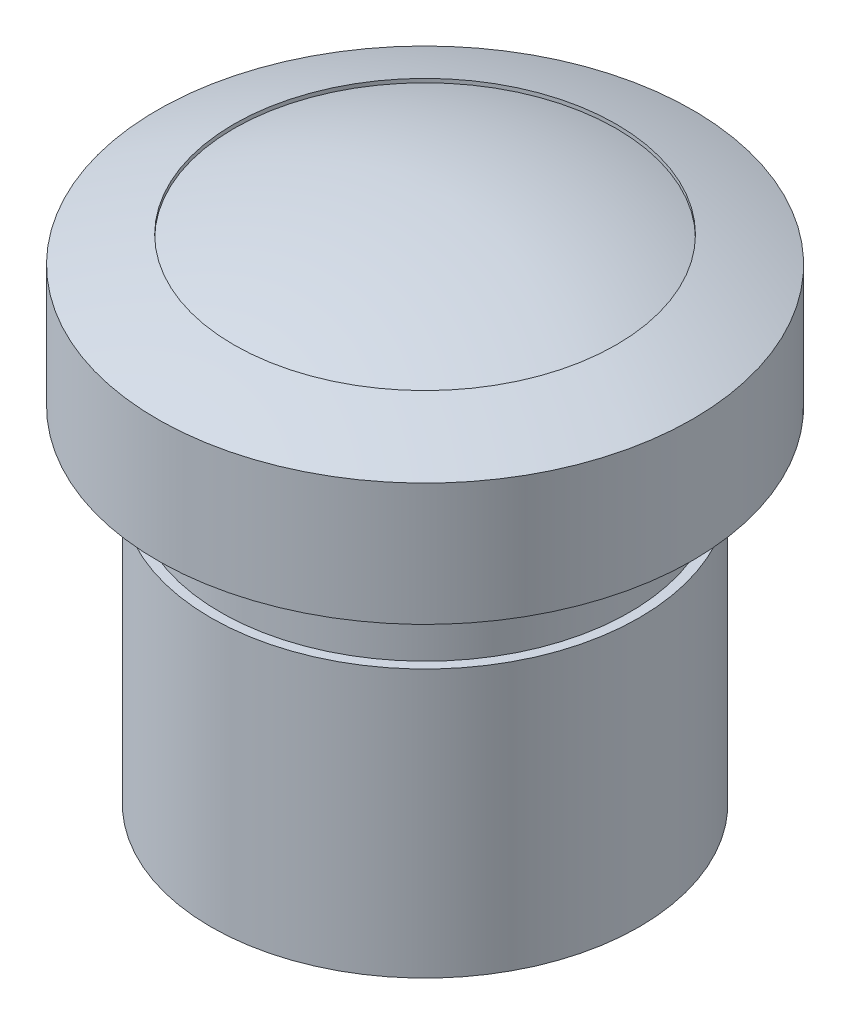
ISO-10303-21;
HEADER;
FILE_DESCRIPTION(('STEP AP214'),'2;1');
FILE_NAME('part.step','',(''),(''),'','','');
FILE_SCHEMA(('AUTOMOTIVE_DESIGN { 1 0 10303 214 1 1 1 1 }'));
ENDSEC;
DATA;
#1=APPLICATION_CONTEXT('core data for automotive mechanical design processes');
#2=APPLICATION_PROTOCOL_DEFINITION('international standard','automotive_design',2000,#1);
#3=PRODUCT_CONTEXT('',#1,'mechanical');
#4=PRODUCT('Part','Part','',(#3));
#5=PRODUCT_RELATED_PRODUCT_CATEGORY('part','',(#4));
#6=PRODUCT_DEFINITION_FORMATION('','',#4);
#7=PRODUCT_DEFINITION_CONTEXT('part definition',#1,'design');
#8=PRODUCT_DEFINITION('design','',#6,#7);
#9=PRODUCT_DEFINITION_SHAPE('','',#8);
#10=(LENGTH_UNIT() NAMED_UNIT(*) SI_UNIT(.MILLI.,.METRE.));
#11=(NAMED_UNIT(*) PLANE_ANGLE_UNIT() SI_UNIT($,.RADIAN.));
#12=(NAMED_UNIT(*) SI_UNIT($,.STERADIAN.) SOLID_ANGLE_UNIT());
#13=UNCERTAINTY_MEASURE_WITH_UNIT(LENGTH_MEASURE(1.E-05),#10,'distance_accuracy_value','');
#14=(GEOMETRIC_REPRESENTATION_CONTEXT(3) GLOBAL_UNCERTAINTY_ASSIGNED_CONTEXT((#13)) GLOBAL_UNIT_ASSIGNED_CONTEXT((#10,
#11,#12)) REPRESENTATION_CONTEXT('',''));
#15=CARTESIAN_POINT('',(0.,0.,0.));
#16=DIRECTION('',(0.,0.,1.));
#17=DIRECTION('',(1.,0.,0.));
#18=AXIS2_PLACEMENT_3D('',#15,#16,#17);
#19=CARTESIAN_POINT('',(0.,-0.363798196587588,0.));
#20=DIRECTION('',(1.,0.,0.));
#21=DIRECTION('',(0.,1.,0.));
#22=AXIS2_PLACEMENT_3D('',#19,#20,#21);
#23=SPHERICAL_SURFACE('',#22,14.0637981965876);
#24=CARTESIAN_POINT('',(0.,12.7811787799742,0.));
#25=DIRECTION('',(0.,-1.,0.));
#26=DIRECTION('',(1.,0.,0.));
#27=AXIS2_PLACEMENT_3D('',#24,#25,#26);
#28=CIRCLE('',#27,5.);
#29=CARTESIAN_POINT('',(5.,12.7811787799742,0.));
#30=VERTEX_POINT('',#29);
#31=EDGE_CURVE('E21',#30,#30,#28,.F.);
#32=ORIENTED_EDGE('',*,*,#31,.T.);
#33=EDGE_LOOP('',(#32));
#34=FACE_BOUND('',#33,.T.);
#35=ADVANCED_FACE('F17',(#34),#23,.T.);
#36=CARTESIAN_POINT('',(0.,9.,0.));
#37=DIRECTION('',(0.,-1.,0.));
#38=DIRECTION('',(1.,0.,0.));
#39=AXIS2_PLACEMENT_3D('',#36,#37,#38);
#40=CYLINDRICAL_SURFACE('',#39,5.);
#41=CARTESIAN_POINT('',(0.,12.8811787799742,0.));
#42=DIRECTION('',(0.,-1.,0.));
#43=DIRECTION('',(1.,0.,0.));
#44=AXIS2_PLACEMENT_3D('',#41,#42,#43);
#45=CIRCLE('',#44,5.);
#46=CARTESIAN_POINT('',(5.,12.8811787799742,0.));
#47=VERTEX_POINT('',#46);
#48=EDGE_CURVE('E366',#47,#47,#45,.T.);
#49=ORIENTED_EDGE('',*,*,#48,.F.);
#50=EDGE_LOOP('',(#49));
#51=FACE_BOUND('',#50,.T.);
#52=ORIENTED_EDGE('',*,*,#31,.F.);
#53=EDGE_LOOP('',(#52));
#54=FACE_BOUND('',#53,.T.);
#55=ADVANCED_FACE('F362',(#51,#54),#40,.F.);
#56=CARTESIAN_POINT('',(-0.841619620452372,-7.54699942395465,0.));
#57=DIRECTION('',(0.,0.,1.));
#58=DIRECTION('',(1.,0.,0.));
#59=AXIS2_PLACEMENT_3D('',#56,#57,#58);
#60=CIRCLE('',#59,21.2469994239546);
#61=TRIMMED_CURVE('',#60,(PARAMETER_VALUE(-1.53117473837219)),
(PARAMETER_VALUE(1.53117473837219)),.T.,.PARAMETER.);
#62=CARTESIAN_POINT('',(0.,-7.54699942395465,0.));
#63=DIRECTION('',(0.,-1.,0.));
#64=AXIS1_PLACEMENT('',#62,#63);
#65=SURFACE_OF_REVOLUTION('',#61,#64);
#66=CARTESIAN_POINT('',(0.,12.2,0.));
#67=DIRECTION('',(0.,-1.,0.));
#68=DIRECTION('',(1.,0.,0.));
#69=AXIS2_PLACEMENT_3D('',#66,#67,#68);
#70=CIRCLE('',#69,7.);
#71=CARTESIAN_POINT('',(7.,12.2,0.));
#72=VERTEX_POINT('',#71);
#73=EDGE_CURVE('E350',#72,#72,#70,.T.);
#74=ORIENTED_EDGE('',*,*,#73,.F.);
#75=EDGE_LOOP('',(#74));
#76=FACE_BOUND('',#75,.T.);
#77=ORIENTED_EDGE('',*,*,#48,.T.);
#78=EDGE_LOOP('',(#77));
#79=FACE_BOUND('',#78,.T.);
#80=ADVANCED_FACE('F358',(#76,#79),#65,.F.);
#81=CARTESIAN_POINT('',(0.,2.83125,0.));
#82=DIRECTION('',(-1.,0.,0.));
#83=DIRECTION('',(0.,1.,0.));
#84=AXIS2_PLACEMENT_3D('',#81,#82,#83);
#85=SPHERICAL_SURFACE('',#84,2.03125);
#86=CARTESIAN_POINT('',(0.,1.8,0.));
#87=DIRECTION('',(0.,-1.,0.));
#88=DIRECTION('',(0.,0.,-1.));
#89=AXIS2_PLACEMENT_3D('',#86,#87,#88);
#90=CIRCLE('',#89,1.75);
#91=CARTESIAN_POINT('',(0.,1.8,-1.75));
#92=VERTEX_POINT('',#91);
#93=EDGE_CURVE('E396',#92,#92,#90,.T.);
#94=ORIENTED_EDGE('',*,*,#93,.T.);
#95=EDGE_LOOP('',(#94));
#96=FACE_BOUND('',#95,.T.);
#97=ADVANCED_FACE('F353',(#96),#85,.T.);
#98=CARTESIAN_POINT('',(0.,9.,0.));
#99=DIRECTION('',(0.,-1.,0.));
#100=DIRECTION('',(1.,0.,0.));
#101=AXIS2_PLACEMENT_3D('',#98,#99,#100);
#102=CYLINDRICAL_SURFACE('',#101,7.);
#103=CARTESIAN_POINT('',(0.,9.00000000000001,0.));
#104=DIRECTION('',(0.,-1.,0.));
#105=DIRECTION('',(1.,0.,0.));
#106=AXIS2_PLACEMENT_3D('',#103,#104,#105);
#107=CIRCLE('',#106,7.);
#108=CARTESIAN_POINT('',(7.,9.00000000000001,0.));
#109=VERTEX_POINT('',#108);
#110=EDGE_CURVE('E394',#109,#109,#107,.F.);
#111=ORIENTED_EDGE('',*,*,#110,.T.);
#112=EDGE_LOOP('',(#111));
#113=FACE_BOUND('',#112,.T.);
#114=ORIENTED_EDGE('',*,*,#73,.T.);
#115=EDGE_LOOP('',(#114));
#116=FACE_BOUND('',#115,.T.);
#117=ADVANCED_FACE('F357',(#113,#116),#102,.T.);
#118=CARTESIAN_POINT('',(0.,1.8,0.));
#119=DIRECTION('',(0.,-1.,0.));
#120=DIRECTION('',(0.,0.,-1.));
#121=AXIS2_PLACEMENT_3D('',#118,#119,#120);
#122=CYLINDRICAL_SURFACE('',#121,1.75);
#123=CARTESIAN_POINT('',(0.,0.8,0.));
#124=DIRECTION('',(0.,-1.,0.));
#125=DIRECTION('',(0.,0.,-1.));
#126=AXIS2_PLACEMENT_3D('',#123,#124,#125);
#127=CIRCLE('',#126,1.75);
#128=CARTESIAN_POINT('',(0.,0.8,-1.75));
#129=VERTEX_POINT('',#128);
#130=EDGE_CURVE('E391',#129,#129,#127,.F.);
#131=ORIENTED_EDGE('',*,*,#130,.F.);
#132=EDGE_LOOP('',(#131));
#133=FACE_BOUND('',#132,.T.);
#134=ORIENTED_EDGE('',*,*,#93,.F.);
#135=EDGE_LOOP('',(#134));
#136=FACE_BOUND('',#135,.T.);
#137=ADVANCED_FACE('F529',(#133,#136),#122,.F.);
#138=CARTESIAN_POINT('',(0.,9.00000000000001,0.));
#139=DIRECTION('',(0.,1.,0.));
#140=DIRECTION('',(-1.,0.,0.));
#141=AXIS2_PLACEMENT_3D('',#138,#139,#140);
#142=PLANE('',#141);
#143=CARTESIAN_POINT('',(0.,9.00000000000001,0.));
#144=DIRECTION('',(0.,1.,0.));
#145=DIRECTION('',(-1.,0.,0.));
#146=AXIS2_PLACEMENT_3D('',#143,#144,#145);
#147=CIRCLE('',#146,5.35);
#148=CARTESIAN_POINT('',(-5.35,9.,0.));
#149=VERTEX_POINT('',#148);
#150=EDGE_CURVE('E300',#149,#149,#147,.F.);
#151=ORIENTED_EDGE('',*,*,#150,.F.);
#152=EDGE_LOOP('',(#151));
#153=FACE_BOUND('',#152,.T.);
#154=ORIENTED_EDGE('',*,*,#110,.F.);
#155=EDGE_LOOP('',(#154));
#156=FACE_BOUND('',#155,.T.);
#157=ADVANCED_FACE('F526',(#153,#156),#142,.F.);
#158=CARTESIAN_POINT('',(0.,0.8,0.));
#159=DIRECTION('',(0.,-1.,0.));
#160=DIRECTION('',(0.,0.,-1.));
#161=AXIS2_PLACEMENT_3D('',#158,#159,#160);
#162=PLANE('',#161);
#163=DIRECTION('',(0.,0.,-1.));
#164=VECTOR('',#163,1.);
#165=CARTESIAN_POINT('',(2.25,0.8,-2.25));
#166=LINE('',#165,#164);
#167=CARTESIAN_POINT('',(2.25,0.8,-2.25));
#168=VERTEX_POINT('',#167);
#169=CARTESIAN_POINT('',(2.25,0.8,2.25));
#170=VERTEX_POINT('',#169);
#171=EDGE_CURVE('E298',#168,#170,#166,.F.);
#172=ORIENTED_EDGE('',*,*,#171,.T.);
#173=DIRECTION('',(1.,0.,0.));
#174=VECTOR('',#173,1.);
#175=CARTESIAN_POINT('',(2.25,0.8,2.25));
#176=LINE('',#175,#174);
#177=CARTESIAN_POINT('',(-2.25,0.8,2.25));
#178=VERTEX_POINT('',#177);
#179=EDGE_CURVE('E293',#170,#178,#176,.F.);
#180=ORIENTED_EDGE('',*,*,#179,.T.);
#181=DIRECTION('',(0.,0.,1.));
#182=VECTOR('',#181,1.);
#183=CARTESIAN_POINT('',(-2.25,0.8,-2.25));
#184=LINE('',#183,#182);
#185=CARTESIAN_POINT('',(-2.25,0.8,-2.25));
#186=VERTEX_POINT('',#185);
#187=EDGE_CURVE('E182',#178,#186,#184,.F.);
#188=ORIENTED_EDGE('',*,*,#187,.T.);
#189=DIRECTION('',(-1.,0.,0.));
#190=VECTOR('',#189,1.);
#191=CARTESIAN_POINT('',(2.25,0.8,-2.25));
#192=LINE('',#191,#190);
#193=EDGE_CURVE('E181',#186,#168,#192,.F.);
#194=ORIENTED_EDGE('',*,*,#193,.T.);
#195=EDGE_LOOP('',(#172,#180,#188,#194));
#196=FACE_BOUND('',#195,.T.);
#197=ORIENTED_EDGE('',*,*,#130,.T.);
#198=EDGE_LOOP('',(#197));
#199=FACE_BOUND('',#198,.T.);
#200=ADVANCED_FACE('F523',(#196,#199),#162,.T.);
#201=CARTESIAN_POINT('',(0.,6.,0.));
#202=DIRECTION('',(0.,-1.,0.));
#203=DIRECTION('',(1.,0.,0.));
#204=AXIS2_PLACEMENT_3D('',#201,#202,#203);
#205=PLANE('',#204);
#206=CARTESIAN_POINT('',(0.,6.,0.));
#207=DIRECTION('',(0.,-1.,0.));
#208=DIRECTION('',(0.,0.,-1.));
#209=AXIS2_PLACEMENT_3D('',#206,#207,#208);
#210=CIRCLE('',#209,5.4);
#211=CARTESIAN_POINT('',(-3.29118425669793,6.,-4.28113375035909));
#212=VERTEX_POINT('',#211);
#213=CARTESIAN_POINT('',(3.29118425669792,6.,-4.2811337503591));
#214=VERTEX_POINT('',#213);
#215=EDGE_CURVE('E269',#212,#214,#210,.T.);
#216=ORIENTED_EDGE('',*,*,#215,.T.);
#217=DIRECTION('',(-0.707106781186546,0.,0.707106781186549));
#218=VECTOR('',#217,1.);
#219=CARTESIAN_POINT('',(3.29118425669792,6.,-4.2811337503591));
#220=LINE('',#219,#218);
#221=CARTESIAN_POINT('',(1.66005050633883,6.,-2.65));
#222=VERTEX_POINT('',#221);
#223=EDGE_CURVE('E287',#222,#214,#220,.F.);
#224=ORIENTED_EDGE('',*,*,#223,.F.);
#225=DIRECTION('',(-1.,0.,0.));
#226=VECTOR('',#225,1.);
#227=CARTESIAN_POINT('',(1.66005050633883,6.,-2.65));
#228=LINE('',#227,#226);
#229=CARTESIAN_POINT('',(-1.66005050633883,6.,-2.65));
#230=VERTEX_POINT('',#229);
#231=EDGE_CURVE('E110',#230,#222,#228,.F.);
#232=ORIENTED_EDGE('',*,*,#231,.F.);
#233=DIRECTION('',(-0.707106781186547,0.,-0.707106781186548));
#234=VECTOR('',#233,1.);
#235=CARTESIAN_POINT('',(-1.66005050633883,6.,-2.65));
#236=LINE('',#235,#234);
#237=EDGE_CURVE('E104',#212,#230,#236,.F.);
#238=ORIENTED_EDGE('',*,*,#237,.F.);
#239=EDGE_LOOP('',(#216,#224,#232,#238));
#240=FACE_BOUND('',#239,.T.);
#241=ADVANCED_FACE('F519',(#240),#205,.T.);
#242=CARTESIAN_POINT('',(0.,6.,0.));
#243=DIRECTION('',(0.,-1.,0.));
#244=DIRECTION('',(1.,0.,0.));
#245=AXIS2_PLACEMENT_3D('',#242,#243,#244);
#246=PLANE('',#245);
#247=DIRECTION('',(-0.707106781186548,0.,0.707106781186547));
#248=VECTOR('',#247,1.);
#249=CARTESIAN_POINT('',(-2.65,6.,1.66005050633883));
#250=LINE('',#249,#248);
#251=CARTESIAN_POINT('',(-4.28113375035909,6.,3.29118425669793));
#252=VERTEX_POINT('',#251);
#253=CARTESIAN_POINT('',(-2.65,6.,1.66005050633883));
#254=VERTEX_POINT('',#253);
#255=EDGE_CURVE('E252',#252,#254,#250,.F.);
#256=ORIENTED_EDGE('',*,*,#255,.F.);
#257=CARTESIAN_POINT('',(0.,6.,0.));
#258=DIRECTION('',(0.,-1.,0.));
#259=DIRECTION('',(0.,0.,-1.));
#260=AXIS2_PLACEMENT_3D('',#257,#258,#259);
#261=CIRCLE('',#260,5.4);
#262=CARTESIAN_POINT('',(-4.28113375035909,6.,-3.29118425669793));
#263=VERTEX_POINT('',#262);
#264=EDGE_CURVE('E245',#252,#263,#261,.T.);
#265=ORIENTED_EDGE('',*,*,#264,.T.);
#266=DIRECTION('',(0.707106781186548,0.,0.707106781186547));
#267=VECTOR('',#266,1.);
#268=CARTESIAN_POINT('',(-2.65,6.,-1.66005050633883));
#269=LINE('',#268,#267);
#270=CARTESIAN_POINT('',(-2.65,6.,-1.66005050633883));
#271=VERTEX_POINT('',#270);
#272=EDGE_CURVE('E325',#271,#263,#269,.F.);
#273=ORIENTED_EDGE('',*,*,#272,.F.);
#274=DIRECTION('',(0.,0.,1.));
#275=VECTOR('',#274,1.);
#276=CARTESIAN_POINT('',(-2.65,6.,-1.66005050633883));
#277=LINE('',#276,#275);
#278=EDGE_CURVE('E264',#254,#271,#277,.F.);
#279=ORIENTED_EDGE('',*,*,#278,.F.);
#280=EDGE_LOOP('',(#256,#265,#273,#279));
#281=FACE_BOUND('',#280,.T.);
#282=ADVANCED_FACE('F515',(#281),#246,.T.);
#283=CARTESIAN_POINT('',(0.,6.,0.));
#284=DIRECTION('',(0.,-1.,0.));
#285=DIRECTION('',(1.,0.,0.));
#286=AXIS2_PLACEMENT_3D('',#283,#284,#285);
#287=PLANE('',#286);
#288=DIRECTION('',(0.707106781186548,0.,0.707106781186547));
#289=VECTOR('',#288,1.);
#290=CARTESIAN_POINT('',(1.66005050633883,5.99999999999999,2.65));
#291=LINE('',#290,#289);
#292=CARTESIAN_POINT('',(3.29118425669793,6.,4.28113375035909));
#293=VERTEX_POINT('',#292);
#294=CARTESIAN_POINT('',(1.66005050633883,5.99999999999999,2.65));
#295=VERTEX_POINT('',#294);
#296=EDGE_CURVE('E227',#293,#295,#291,.F.);
#297=ORIENTED_EDGE('',*,*,#296,.F.);
#298=CARTESIAN_POINT('',(0.,6.,0.));
#299=DIRECTION('',(0.,-1.,0.));
#300=DIRECTION('',(0.,0.,-1.));
#301=AXIS2_PLACEMENT_3D('',#298,#299,#300);
#302=CIRCLE('',#301,5.4);
#303=CARTESIAN_POINT('',(-3.29118425669792,6.,4.2811337503591));
#304=VERTEX_POINT('',#303);
#305=EDGE_CURVE('E220',#293,#304,#302,.T.);
#306=ORIENTED_EDGE('',*,*,#305,.T.);
#307=DIRECTION('',(0.707106781186546,0.,-0.707106781186549));
#308=VECTOR('',#307,1.);
#309=CARTESIAN_POINT('',(-1.66005050633883,5.99999999999999,2.65));
#310=LINE('',#309,#308);
#311=CARTESIAN_POINT('',(-1.66005050633883,6.,2.65));
#312=VERTEX_POINT('',#311);
#313=EDGE_CURVE('E244',#312,#304,#310,.F.);
#314=ORIENTED_EDGE('',*,*,#313,.F.);
#315=DIRECTION('',(1.,0.,0.));
#316=VECTOR('',#315,1.);
#317=CARTESIAN_POINT('',(1.66005050633883,6.,2.65));
#318=LINE('',#317,#316);
#319=EDGE_CURVE('E239',#295,#312,#318,.F.);
#320=ORIENTED_EDGE('',*,*,#319,.F.);
#321=EDGE_LOOP('',(#297,#306,#314,#320));
#322=FACE_BOUND('',#321,.T.);
#323=ADVANCED_FACE('F511',(#322),#287,.T.);
#324=CARTESIAN_POINT('',(0.,6.,0.));
#325=DIRECTION('',(0.,-1.,0.));
#326=DIRECTION('',(1.,0.,0.));
#327=AXIS2_PLACEMENT_3D('',#324,#325,#326);
#328=PLANE('',#327);
#329=DIRECTION('',(0.707106781186549,0.,-0.707106781186546));
#330=VECTOR('',#329,1.);
#331=CARTESIAN_POINT('',(4.2811337503591,6.,-3.29118425669792));
#332=LINE('',#331,#330);
#333=CARTESIAN_POINT('',(4.2811337503591,6.,-3.29118425669792));
#334=VERTEX_POINT('',#333);
#335=CARTESIAN_POINT('',(2.65,6.,-1.66005050633883));
#336=VERTEX_POINT('',#335);
#337=EDGE_CURVE('E203',#334,#336,#332,.F.);
#338=ORIENTED_EDGE('',*,*,#337,.F.);
#339=CARTESIAN_POINT('',(0.,6.,0.));
#340=DIRECTION('',(0.,-1.,0.));
#341=DIRECTION('',(0.,0.,-1.));
#342=AXIS2_PLACEMENT_3D('',#339,#340,#341);
#343=CIRCLE('',#342,5.4);
#344=CARTESIAN_POINT('',(4.28113375035909,6.,3.29118425669793));
#345=VERTEX_POINT('',#344);
#346=EDGE_CURVE('E198',#334,#345,#343,.T.);
#347=ORIENTED_EDGE('',*,*,#346,.T.);
#348=DIRECTION('',(-0.707106781186547,0.,-0.707106781186548));
#349=VECTOR('',#348,1.);
#350=CARTESIAN_POINT('',(2.65,6.,1.66005050633883));
#351=LINE('',#350,#349);
#352=CARTESIAN_POINT('',(2.65,6.,1.66005050633883));
#353=VERTEX_POINT('',#352);
#354=EDGE_CURVE('E219',#353,#345,#351,.F.);
#355=ORIENTED_EDGE('',*,*,#354,.F.);
#356=DIRECTION('',(0.,0.,-1.));
#357=VECTOR('',#356,1.);
#358=CARTESIAN_POINT('',(2.65,6.,-1.66005050633883));
#359=LINE('',#358,#357);
#360=EDGE_CURVE('E214',#336,#353,#359,.F.);
#361=ORIENTED_EDGE('',*,*,#360,.F.);
#362=EDGE_LOOP('',(#338,#347,#355,#361));
#363=FACE_BOUND('',#362,.T.);
#364=ADVANCED_FACE('F507',(#363),#328,.T.);
#365=CARTESIAN_POINT('',(0.,7.,0.));
#366=DIRECTION('',(0.,1.,0.));
#367=DIRECTION('',(-1.,0.,0.));
#368=AXIS2_PLACEMENT_3D('',#365,#366,#367);
#369=CYLINDRICAL_SURFACE('',#368,5.35);
#370=CARTESIAN_POINT('',(0.,7.,0.));
#371=DIRECTION('',(0.,1.,0.));
#372=DIRECTION('',(-1.,0.,0.));
#373=AXIS2_PLACEMENT_3D('',#370,#371,#372);
#374=CIRCLE('',#373,5.35);
#375=CARTESIAN_POINT('',(-5.35,7.,0.));
#376=VERTEX_POINT('',#375);
#377=EDGE_CURVE('E195',#376,#376,#374,.T.);
#378=ORIENTED_EDGE('',*,*,#377,.T.);
#379=EDGE_LOOP('',(#378));
#380=FACE_BOUND('',#379,.T.);
#381=ORIENTED_EDGE('',*,*,#150,.T.);
#382=EDGE_LOOP('',(#381));
#383=FACE_BOUND('',#382,.T.);
#384=ADVANCED_FACE('F503',(#380,#383),#369,.T.);
#385=CARTESIAN_POINT('',(2.25,0.8,-2.25));
#386=DIRECTION('',(1.,0.,0.));
#387=DIRECTION('',(0.,0.,-1.));
#388=AXIS2_PLACEMENT_3D('',#385,#386,#387);
#389=PLANE('',#388);
#390=DIRECTION('',(0.,1.,0.));
#391=VECTOR('',#390,1.);
#392=CARTESIAN_POINT('',(2.25,0.8,2.25));
#393=LINE('',#392,#391);
#394=CARTESIAN_POINT('',(2.25,0.,2.25));
#395=VERTEX_POINT('',#394);
#396=EDGE_CURVE('E295',#395,#170,#393,.T.);
#397=ORIENTED_EDGE('',*,*,#396,.T.);
#398=ORIENTED_EDGE('',*,*,#171,.F.);
#399=DIRECTION('',(0.,1.,0.));
#400=VECTOR('',#399,1.);
#401=CARTESIAN_POINT('',(2.25,0.8,-2.25));
#402=LINE('',#401,#400);
#403=CARTESIAN_POINT('',(2.25,0.,-2.25));
#404=VERTEX_POINT('',#403);
#405=EDGE_CURVE('E288',#168,#404,#402,.F.);
#406=ORIENTED_EDGE('',*,*,#405,.T.);
#407=DIRECTION('',(0.,0.,1.));
#408=VECTOR('',#407,1.);
#409=CARTESIAN_POINT('',(2.25,0.,0.));
#410=LINE('',#409,#408);
#411=EDGE_CURVE('E185',#404,#395,#410,.T.);
#412=ORIENTED_EDGE('',*,*,#411,.T.);
#413=EDGE_LOOP('',(#397,#398,#406,#412));
#414=FACE_BOUND('',#413,.T.);
#415=ADVANCED_FACE('F499',(#414),#389,.F.);
#416=CARTESIAN_POINT('',(2.25,0.8,2.25));
#417=DIRECTION('',(0.,0.,1.));
#418=DIRECTION('',(1.,0.,0.));
#419=AXIS2_PLACEMENT_3D('',#416,#417,#418);
#420=PLANE('',#419);
#421=DIRECTION('',(0.,1.,0.));
#422=VECTOR('',#421,1.);
#423=CARTESIAN_POINT('',(-2.25,0.8,2.25));
#424=LINE('',#423,#422);
#425=CARTESIAN_POINT('',(-2.25,0.,2.25));
#426=VERTEX_POINT('',#425);
#427=EDGE_CURVE('E169',#426,#178,#424,.T.);
#428=ORIENTED_EDGE('',*,*,#427,.T.);
#429=ORIENTED_EDGE('',*,*,#179,.F.);
#430=ORIENTED_EDGE('',*,*,#396,.F.);
#431=DIRECTION('',(1.,0.,0.));
#432=VECTOR('',#431,1.);
#433=CARTESIAN_POINT('',(0.,0.,2.25));
#434=LINE('',#433,#432);
#435=EDGE_CURVE('E174',#395,#426,#434,.F.);
#436=ORIENTED_EDGE('',*,*,#435,.T.);
#437=EDGE_LOOP('',(#428,#429,#430,#436));
#438=FACE_BOUND('',#437,.T.);
#439=ADVANCED_FACE('F496',(#438),#420,.F.);
#440=CARTESIAN_POINT('',(-2.25,0.8,-2.25));
#441=DIRECTION('',(-1.,0.,0.));
#442=DIRECTION('',(0.,0.,1.));
#443=AXIS2_PLACEMENT_3D('',#440,#441,#442);
#444=PLANE('',#443);
#445=DIRECTION('',(0.,1.,0.));
#446=VECTOR('',#445,1.);
#447=CARTESIAN_POINT('',(-2.25,0.8,-2.25));
#448=LINE('',#447,#446);
#449=CARTESIAN_POINT('',(-2.25,0.,-2.25));
#450=VERTEX_POINT('',#449);
#451=EDGE_CURVE('E166',#450,#186,#448,.T.);
#452=ORIENTED_EDGE('',*,*,#451,.T.);
#453=ORIENTED_EDGE('',*,*,#187,.F.);
#454=ORIENTED_EDGE('',*,*,#427,.F.);
#455=DIRECTION('',(0.,0.,1.));
#456=VECTOR('',#455,1.);
#457=CARTESIAN_POINT('',(-2.25,0.,0.));
#458=LINE('',#457,#456);
#459=EDGE_CURVE('E162',#426,#450,#458,.F.);
#460=ORIENTED_EDGE('',*,*,#459,.T.);
#461=EDGE_LOOP('',(#452,#453,#454,#460));
#462=FACE_BOUND('',#461,.T.);
#463=ADVANCED_FACE('F164',(#462),#444,.F.);
#464=CARTESIAN_POINT('',(2.25,0.8,-2.25));
#465=DIRECTION('',(0.,0.,-1.));
#466=DIRECTION('',(-1.,0.,0.));
#467=AXIS2_PLACEMENT_3D('',#464,#465,#466);
#468=PLANE('',#467);
#469=ORIENTED_EDGE('',*,*,#405,.F.);
#470=ORIENTED_EDGE('',*,*,#193,.F.);
#471=ORIENTED_EDGE('',*,*,#451,.F.);
#472=DIRECTION('',(1.,0.,0.));
#473=VECTOR('',#472,1.);
#474=CARTESIAN_POINT('',(0.,0.,-2.25));
#475=LINE('',#474,#473);
#476=EDGE_CURVE('E173',#450,#404,#475,.T.);
#477=ORIENTED_EDGE('',*,*,#476,.T.);
#478=EDGE_LOOP('',(#469,#470,#471,#477));
#479=FACE_BOUND('',#478,.T.);
#480=ADVANCED_FACE('F179',(#479),#468,.F.);
#481=CARTESIAN_POINT('',(3.29118425669792,18.1088748241821,-4.2811337503591));
#482=DIRECTION('',(-0.707106781186549,0.,-0.707106781186546));
#483=DIRECTION('',(-0.707106781186546,0.,0.707106781186549));
#484=AXIS2_PLACEMENT_3D('',#481,#482,#483);
#485=PLANE('',#484);
#486=DIRECTION('',(-0.707106781186546,0.,0.707106781186549));
#487=VECTOR('',#486,1.);
#488=CARTESIAN_POINT('',(3.29118425669792,0.,-4.2811337503591));
#489=LINE('',#488,#487);
#490=CARTESIAN_POINT('',(3.29118425669792,0.,-4.2811337503591));
#491=VERTEX_POINT('',#490);
#492=CARTESIAN_POINT('',(1.66005050633883,0.,-2.65));
#493=VERTEX_POINT('',#492);
#494=EDGE_CURVE('E186',#491,#493,#489,.T.);
#495=ORIENTED_EDGE('',*,*,#494,.T.);
#496=DIRECTION('',(0.,1.,0.));
#497=VECTOR('',#496,1.);
#498=CARTESIAN_POINT('',(1.66005050633883,18.1088748241821,-2.65));
#499=LINE('',#498,#497);
#500=EDGE_CURVE('E279',#222,#493,#499,.F.);
#501=ORIENTED_EDGE('',*,*,#500,.F.);
#502=ORIENTED_EDGE('',*,*,#223,.T.);
#503=DIRECTION('',(0.,1.,0.));
#504=VECTOR('',#503,1.);
#505=CARTESIAN_POINT('',(3.29118425669792,18.1088748241821,-4.2811337503591));
#506=LINE('',#505,#504);
#507=EDGE_CURVE('E284',#214,#491,#506,.F.);
#508=ORIENTED_EDGE('',*,*,#507,.T.);
#509=EDGE_LOOP('',(#495,#501,#502,#508));
#510=FACE_BOUND('',#509,.T.);
#511=ADVANCED_FACE('F487',(#510),#485,.T.);
#512=CARTESIAN_POINT('',(1.66005050633883,18.1088748241821,-2.65));
#513=DIRECTION('',(0.,0.,-1.));
#514=DIRECTION('',(-1.,0.,0.));
#515=AXIS2_PLACEMENT_3D('',#512,#513,#514);
#516=PLANE('',#515);
#517=DIRECTION('',(1.,0.,0.));
#518=VECTOR('',#517,1.);
#519=CARTESIAN_POINT('',(0.,0.,-2.65));
#520=LINE('',#519,#518);
#521=CARTESIAN_POINT('',(-1.66005050633883,0.,-2.65));
#522=VERTEX_POINT('',#521);
#523=EDGE_CURVE('E188',#493,#522,#520,.F.);
#524=ORIENTED_EDGE('',*,*,#523,.T.);
#525=DIRECTION('',(0.,1.,0.));
#526=VECTOR('',#525,1.);
#527=CARTESIAN_POINT('',(-1.66005050633883,18.1088748241821,-2.65));
#528=LINE('',#527,#526);
#529=EDGE_CURVE('E270',#230,#522,#528,.F.);
#530=ORIENTED_EDGE('',*,*,#529,.F.);
#531=ORIENTED_EDGE('',*,*,#231,.T.);
#532=ORIENTED_EDGE('',*,*,#500,.T.);
#533=EDGE_LOOP('',(#524,#530,#531,#532));
#534=FACE_BOUND('',#533,.T.);
#535=ADVANCED_FACE('F483',(#534),#516,.T.);
#536=CARTESIAN_POINT('',(-1.66005050633883,18.1088748241821,-2.65));
#537=DIRECTION('',(0.707106781186548,0.,-0.707106781186547));
#538=DIRECTION('',(-0.707106781186547,0.,-0.707106781186548));
#539=AXIS2_PLACEMENT_3D('',#536,#537,#538);
#540=PLANE('',#539);
#541=DIRECTION('',(-0.707106781186547,0.,-0.707106781186548));
#542=VECTOR('',#541,1.);
#543=CARTESIAN_POINT('',(-1.66005050633883,0.,-2.65));
#544=LINE('',#543,#542);
#545=CARTESIAN_POINT('',(-3.29118425669793,0.,-4.28113375035909));
#546=VERTEX_POINT('',#545);
#547=EDGE_CURVE('E276',#522,#546,#544,.T.);
#548=ORIENTED_EDGE('',*,*,#547,.T.);
#549=DIRECTION('',(0.,-1.,0.));
#550=VECTOR('',#549,1.);
#551=CARTESIAN_POINT('',(-3.29118425669793,22.2735064736294,-4.28113375035909));
#552=LINE('',#551,#550);
#553=EDGE_CURVE('E267',#546,#212,#552,.F.);
#554=ORIENTED_EDGE('',*,*,#553,.T.);
#555=ORIENTED_EDGE('',*,*,#237,.T.);
#556=ORIENTED_EDGE('',*,*,#529,.T.);
#557=EDGE_LOOP('',(#548,#554,#555,#556));
#558=FACE_BOUND('',#557,.T.);
#559=ADVANCED_FACE('F479',(#558),#540,.T.);
#560=CARTESIAN_POINT('',(0.,22.2735064736294,0.));
#561=DIRECTION('',(0.,-1.,0.));
#562=DIRECTION('',(0.,0.,-1.));
#563=AXIS2_PLACEMENT_3D('',#560,#561,#562);
#564=CYLINDRICAL_SURFACE('',#563,5.4);
#565=ORIENTED_EDGE('',*,*,#215,.F.);
#566=ORIENTED_EDGE('',*,*,#553,.F.);
#567=CARTESIAN_POINT('',(0.,0.,0.));
#568=DIRECTION('',(0.,-1.,0.));
#569=DIRECTION('',(0.,0.,-1.));
#570=AXIS2_PLACEMENT_3D('',#567,#568,#569);
#571=CIRCLE('',#570,5.4);
#572=EDGE_CURVE('E381',#546,#491,#571,.T.);
#573=ORIENTED_EDGE('',*,*,#572,.T.);
#574=ORIENTED_EDGE('',*,*,#507,.F.);
#575=EDGE_LOOP('',(#565,#566,#573,#574));
#576=FACE_BOUND('',#575,.T.);
#577=ADVANCED_FACE('F475',(#576),#564,.F.);
#578=CARTESIAN_POINT('',(-2.65,18.1088748241821,-1.66005050633883));
#579=DIRECTION('',(-0.707106781186547,0.,0.707106781186548));
#580=DIRECTION('',(0.707106781186548,0.,0.707106781186547));
#581=AXIS2_PLACEMENT_3D('',#578,#579,#580);
#582=PLANE('',#581);
#583=DIRECTION('',(0.707106781186548,0.,0.707106781186547));
#584=VECTOR('',#583,1.);
#585=CARTESIAN_POINT('',(-4.28113375035909,0.,-3.29118425669793));
#586=LINE('',#585,#584);
#587=CARTESIAN_POINT('',(-4.28113375035909,0.,-3.29118425669793));
#588=VERTEX_POINT('',#587);
#589=CARTESIAN_POINT('',(-2.65,0.,-1.66005050633883));
#590=VERTEX_POINT('',#589);
#591=EDGE_CURVE('E258',#588,#590,#586,.T.);
#592=ORIENTED_EDGE('',*,*,#591,.T.);
#593=DIRECTION('',(0.,1.,0.));
#594=VECTOR('',#593,1.);
#595=CARTESIAN_POINT('',(-2.65,18.1088748241821,-1.66005050633883));
#596=LINE('',#595,#594);
#597=EDGE_CURVE('E261',#271,#590,#596,.F.);
#598=ORIENTED_EDGE('',*,*,#597,.F.);
#599=ORIENTED_EDGE('',*,*,#272,.T.);
#600=DIRECTION('',(0.,-1.,0.));
#601=VECTOR('',#600,1.);
#602=CARTESIAN_POINT('',(-4.28113375035909,22.2735064736294,-3.29118425669793));
#603=LINE('',#602,#601);
#604=EDGE_CURVE('E242',#263,#588,#603,.T.);
#605=ORIENTED_EDGE('',*,*,#604,.T.);
#606=EDGE_LOOP('',(#592,#598,#599,#605));
#607=FACE_BOUND('',#606,.T.);
#608=ADVANCED_FACE('F471',(#607),#582,.T.);
#609=CARTESIAN_POINT('',(-2.65,18.1088748241821,-1.66005050633883));
#610=DIRECTION('',(-1.,0.,0.));
#611=DIRECTION('',(0.,0.,1.));
#612=AXIS2_PLACEMENT_3D('',#609,#610,#611);
#613=PLANE('',#612);
#614=DIRECTION('',(0.,0.,1.));
#615=VECTOR('',#614,1.);
#616=CARTESIAN_POINT('',(-2.65,0.,0.));
#617=LINE('',#616,#615);
#618=CARTESIAN_POINT('',(-2.65,0.,1.66005050633883));
#619=VERTEX_POINT('',#618);
#620=EDGE_CURVE('E255',#590,#619,#617,.T.);
#621=ORIENTED_EDGE('',*,*,#620,.T.);
#622=DIRECTION('',(0.,1.,0.));
#623=VECTOR('',#622,1.);
#624=CARTESIAN_POINT('',(-2.65,18.1088748241821,1.66005050633883));
#625=LINE('',#624,#623);
#626=EDGE_CURVE('E249',#254,#619,#625,.F.);
#627=ORIENTED_EDGE('',*,*,#626,.F.);
#628=ORIENTED_EDGE('',*,*,#278,.T.);
#629=ORIENTED_EDGE('',*,*,#597,.T.);
#630=EDGE_LOOP('',(#621,#627,#628,#629));
#631=FACE_BOUND('',#630,.T.);
#632=ADVANCED_FACE('F467',(#631),#613,.T.);
#633=CARTESIAN_POINT('',(-2.65,18.1088748241821,1.66005050633883));
#634=DIRECTION('',(-0.707106781186547,0.,-0.707106781186548));
#635=DIRECTION('',(-0.707106781186548,0.,0.707106781186547));
#636=AXIS2_PLACEMENT_3D('',#633,#634,#635);
#637=PLANE('',#636);
#638=DIRECTION('',(-0.707106781186548,0.,0.707106781186547));
#639=VECTOR('',#638,1.);
#640=CARTESIAN_POINT('',(-2.65,0.,1.66005050633883));
#641=LINE('',#640,#639);
#642=CARTESIAN_POINT('',(-4.28113375035909,0.,3.29118425669793));
#643=VERTEX_POINT('',#642);
#644=EDGE_CURVE('E257',#619,#643,#641,.T.);
#645=ORIENTED_EDGE('',*,*,#644,.T.);
#646=DIRECTION('',(0.,-1.,0.));
#647=VECTOR('',#646,1.);
#648=CARTESIAN_POINT('',(-4.28113375035909,22.2735064736294,3.29118425669793));
#649=LINE('',#648,#647);
#650=EDGE_CURVE('E246',#643,#252,#649,.F.);
#651=ORIENTED_EDGE('',*,*,#650,.T.);
#652=ORIENTED_EDGE('',*,*,#255,.T.);
#653=ORIENTED_EDGE('',*,*,#626,.T.);
#654=EDGE_LOOP('',(#645,#651,#652,#653));
#655=FACE_BOUND('',#654,.T.);
#656=ADVANCED_FACE('F463',(#655),#637,.T.);
#657=CARTESIAN_POINT('',(0.,22.2735064736294,0.));
#658=DIRECTION('',(0.,-1.,0.));
#659=DIRECTION('',(0.,0.,-1.));
#660=AXIS2_PLACEMENT_3D('',#657,#658,#659);
#661=CYLINDRICAL_SURFACE('',#660,5.4);
#662=ORIENTED_EDGE('',*,*,#604,.F.);
#663=ORIENTED_EDGE('',*,*,#264,.F.);
#664=ORIENTED_EDGE('',*,*,#650,.F.);
#665=CARTESIAN_POINT('',(0.,0.,0.));
#666=DIRECTION('',(0.,-1.,0.));
#667=DIRECTION('',(0.,0.,-1.));
#668=AXIS2_PLACEMENT_3D('',#665,#666,#667);
#669=CIRCLE('',#668,5.4);
#670=EDGE_CURVE('E378',#643,#588,#669,.T.);
#671=ORIENTED_EDGE('',*,*,#670,.T.);
#672=EDGE_LOOP('',(#662,#663,#664,#671));
#673=FACE_BOUND('',#672,.T.);
#674=ADVANCED_FACE('F459',(#673),#661,.F.);
#675=CARTESIAN_POINT('',(-1.66005050633883,18.1088748241821,2.65));
#676=DIRECTION('',(0.707106781186549,0.,0.707106781186546));
#677=DIRECTION('',(0.707106781186546,0.,-0.707106781186549));
#678=AXIS2_PLACEMENT_3D('',#675,#676,#677);
#679=PLANE('',#678);
#680=DIRECTION('',(0.707106781186546,0.,-0.707106781186549));
#681=VECTOR('',#680,1.);
#682=CARTESIAN_POINT('',(-3.29118425669792,0.,4.2811337503591));
#683=LINE('',#682,#681);
#684=CARTESIAN_POINT('',(-3.29118425669792,0.,4.2811337503591));
#685=VERTEX_POINT('',#684);
#686=CARTESIAN_POINT('',(-1.66005050633883,0.,2.65));
#687=VERTEX_POINT('',#686);
#688=EDGE_CURVE('E233',#685,#687,#683,.T.);
#689=ORIENTED_EDGE('',*,*,#688,.T.);
#690=DIRECTION('',(0.,1.,0.));
#691=VECTOR('',#690,1.);
#692=CARTESIAN_POINT('',(-1.66005050633883,18.1088748241821,2.65));
#693=LINE('',#692,#691);
#694=EDGE_CURVE('E236',#312,#687,#693,.F.);
#695=ORIENTED_EDGE('',*,*,#694,.F.);
#696=ORIENTED_EDGE('',*,*,#313,.T.);
#697=DIRECTION('',(0.,-1.,0.));
#698=VECTOR('',#697,1.);
#699=CARTESIAN_POINT('',(-3.29118425669792,22.2735064736294,4.2811337503591));
#700=LINE('',#699,#698);
#701=EDGE_CURVE('E217',#304,#685,#700,.T.);
#702=ORIENTED_EDGE('',*,*,#701,.T.);
#703=EDGE_LOOP('',(#689,#695,#696,#702));
#704=FACE_BOUND('',#703,.T.);
#705=ADVANCED_FACE('F455',(#704),#679,.T.);
#706=CARTESIAN_POINT('',(1.66005050633883,18.1088748241821,2.65));
#707=DIRECTION('',(0.,0.,1.));
#708=DIRECTION('',(1.,0.,0.));
#709=AXIS2_PLACEMENT_3D('',#706,#707,#708);
#710=PLANE('',#709);
#711=DIRECTION('',(1.,0.,0.));
#712=VECTOR('',#711,1.);
#713=CARTESIAN_POINT('',(0.,0.,2.65));
#714=LINE('',#713,#712);
#715=CARTESIAN_POINT('',(1.66005050633883,0.,2.65));
#716=VERTEX_POINT('',#715);
#717=EDGE_CURVE('E230',#687,#716,#714,.T.);
#718=ORIENTED_EDGE('',*,*,#717,.T.);
#719=DIRECTION('',(0.,1.,0.));
#720=VECTOR('',#719,1.);
#721=CARTESIAN_POINT('',(1.66005050633883,18.1088748241821,2.65));
#722=LINE('',#721,#720);
#723=EDGE_CURVE('E224',#295,#716,#722,.F.);
#724=ORIENTED_EDGE('',*,*,#723,.F.);
#725=ORIENTED_EDGE('',*,*,#319,.T.);
#726=ORIENTED_EDGE('',*,*,#694,.T.);
#727=EDGE_LOOP('',(#718,#724,#725,#726));
#728=FACE_BOUND('',#727,.T.);
#729=ADVANCED_FACE('F451',(#728),#710,.T.);
#730=CARTESIAN_POINT('',(1.66005050633883,18.1088748241821,2.65));
#731=DIRECTION('',(-0.707106781186547,0.,0.707106781186548));
#732=DIRECTION('',(0.707106781186548,0.,0.707106781186547));
#733=AXIS2_PLACEMENT_3D('',#730,#731,#732);
#734=PLANE('',#733);
#735=DIRECTION('',(0.707106781186548,0.,0.707106781186547));
#736=VECTOR('',#735,1.);
#737=CARTESIAN_POINT('',(1.66005050633883,0.,2.65));
#738=LINE('',#737,#736);
#739=CARTESIAN_POINT('',(3.29118425669793,0.,4.28113375035909));
#740=VERTEX_POINT('',#739);
#741=EDGE_CURVE('E232',#716,#740,#738,.T.);
#742=ORIENTED_EDGE('',*,*,#741,.T.);
#743=DIRECTION('',(0.,-1.,0.));
#744=VECTOR('',#743,1.);
#745=CARTESIAN_POINT('',(3.29118425669793,22.2735064736294,4.28113375035909));
#746=LINE('',#745,#744);
#747=EDGE_CURVE('E221',#740,#293,#746,.F.);
#748=ORIENTED_EDGE('',*,*,#747,.T.);
#749=ORIENTED_EDGE('',*,*,#296,.T.);
#750=ORIENTED_EDGE('',*,*,#723,.T.);
#751=EDGE_LOOP('',(#742,#748,#749,#750));
#752=FACE_BOUND('',#751,.T.);
#753=ADVANCED_FACE('F447',(#752),#734,.T.);
#754=CARTESIAN_POINT('',(0.,22.2735064736294,0.));
#755=DIRECTION('',(0.,-1.,0.));
#756=DIRECTION('',(0.,0.,-1.));
#757=AXIS2_PLACEMENT_3D('',#754,#755,#756);
#758=CYLINDRICAL_SURFACE('',#757,5.4);
#759=ORIENTED_EDGE('',*,*,#701,.F.);
#760=ORIENTED_EDGE('',*,*,#305,.F.);
#761=ORIENTED_EDGE('',*,*,#747,.F.);
#762=CARTESIAN_POINT('',(0.,0.,0.));
#763=DIRECTION('',(0.,-1.,0.));
#764=DIRECTION('',(0.,0.,-1.));
#765=AXIS2_PLACEMENT_3D('',#762,#763,#764);
#766=CIRCLE('',#765,5.4);
#767=EDGE_CURVE('E375',#740,#685,#766,.T.);
#768=ORIENTED_EDGE('',*,*,#767,.T.);
#769=EDGE_LOOP('',(#759,#760,#761,#768));
#770=FACE_BOUND('',#769,.T.);
#771=ADVANCED_FACE('F443',(#770),#758,.F.);
#772=CARTESIAN_POINT('',(2.65,18.1088748241821,1.66005050633883));
#773=DIRECTION('',(0.707106781186548,0.,-0.707106781186547));
#774=DIRECTION('',(-0.707106781186547,0.,-0.707106781186548));
#775=AXIS2_PLACEMENT_3D('',#772,#773,#774);
#776=PLANE('',#775);
#777=DIRECTION('',(-0.707106781186547,0.,-0.707106781186548));
#778=VECTOR('',#777,1.);
#779=CARTESIAN_POINT('',(4.28113375035909,0.,3.29118425669793));
#780=LINE('',#779,#778);
#781=CARTESIAN_POINT('',(4.28113375035909,0.,3.29118425669793));
#782=VERTEX_POINT('',#781);
#783=CARTESIAN_POINT('',(2.65,0.,1.66005050633883));
#784=VERTEX_POINT('',#783);
#785=EDGE_CURVE('E208',#782,#784,#780,.T.);
#786=ORIENTED_EDGE('',*,*,#785,.T.);
#787=DIRECTION('',(0.,1.,0.));
#788=VECTOR('',#787,1.);
#789=CARTESIAN_POINT('',(2.65,18.1088748241821,1.66005050633883));
#790=LINE('',#789,#788);
#791=EDGE_CURVE('E211',#353,#784,#790,.F.);
#792=ORIENTED_EDGE('',*,*,#791,.F.);
#793=ORIENTED_EDGE('',*,*,#354,.T.);
#794=DIRECTION('',(0.,-1.,0.));
#795=VECTOR('',#794,1.);
#796=CARTESIAN_POINT('',(4.28113375035909,22.2735064736294,3.29118425669793));
#797=LINE('',#796,#795);
#798=EDGE_CURVE('E196',#345,#782,#797,.T.);
#799=ORIENTED_EDGE('',*,*,#798,.T.);
#800=EDGE_LOOP('',(#786,#792,#793,#799));
#801=FACE_BOUND('',#800,.T.);
#802=ADVANCED_FACE('F439',(#801),#776,.T.);
#803=CARTESIAN_POINT('',(2.65,18.1088748241821,-1.66005050633883));
#804=DIRECTION('',(1.,0.,0.));
#805=DIRECTION('',(0.,0.,-1.));
#806=AXIS2_PLACEMENT_3D('',#803,#804,#805);
#807=PLANE('',#806);
#808=DIRECTION('',(0.,0.,1.));
#809=VECTOR('',#808,1.);
#810=CARTESIAN_POINT('',(2.65,0.,0.));
#811=LINE('',#810,#809);
#812=CARTESIAN_POINT('',(2.65,0.,-1.66005050633883));
#813=VERTEX_POINT('',#812);
#814=EDGE_CURVE('E206',#784,#813,#811,.F.);
#815=ORIENTED_EDGE('',*,*,#814,.T.);
#816=DIRECTION('',(0.,1.,0.));
#817=VECTOR('',#816,1.);
#818=CARTESIAN_POINT('',(2.65,18.1088748241821,-1.66005050633883));
#819=LINE('',#818,#817);
#820=EDGE_CURVE('E201',#336,#813,#819,.F.);
#821=ORIENTED_EDGE('',*,*,#820,.F.);
#822=ORIENTED_EDGE('',*,*,#360,.T.);
#823=ORIENTED_EDGE('',*,*,#791,.T.);
#824=EDGE_LOOP('',(#815,#821,#822,#823));
#825=FACE_BOUND('',#824,.T.);
#826=ADVANCED_FACE('F436',(#825),#807,.T.);
#827=CARTESIAN_POINT('',(4.2811337503591,18.1088748241821,-3.29118425669792));
#828=DIRECTION('',(0.707106781186546,0.,0.707106781186549));
#829=DIRECTION('',(0.707106781186549,0.,-0.707106781186546));
#830=AXIS2_PLACEMENT_3D('',#827,#828,#829);
#831=PLANE('',#830);
#832=DIRECTION('',(0.707106781186549,0.,-0.707106781186546));
#833=VECTOR('',#832,1.);
#834=CARTESIAN_POINT('',(2.65,0.,-1.66005050633883));
#835=LINE('',#834,#833);
#836=CARTESIAN_POINT('',(4.2811337503591,0.,-3.29118425669792));
#837=VERTEX_POINT('',#836);
#838=EDGE_CURVE('E36',#813,#837,#835,.T.);
#839=ORIENTED_EDGE('',*,*,#838,.T.);
#840=DIRECTION('',(0.,-1.,0.));
#841=VECTOR('',#840,1.);
#842=CARTESIAN_POINT('',(4.2811337503591,22.2735064736294,-3.29118425669792));
#843=LINE('',#842,#841);
#844=EDGE_CURVE('E199',#837,#334,#843,.F.);
#845=ORIENTED_EDGE('',*,*,#844,.T.);
#846=ORIENTED_EDGE('',*,*,#337,.T.);
#847=ORIENTED_EDGE('',*,*,#820,.T.);
#848=EDGE_LOOP('',(#839,#845,#846,#847));
#849=FACE_BOUND('',#848,.T.);
#850=ADVANCED_FACE('F432',(#849),#831,.T.);
#851=CARTESIAN_POINT('',(0.,22.2735064736294,0.));
#852=DIRECTION('',(0.,-1.,0.));
#853=DIRECTION('',(0.,0.,-1.));
#854=AXIS2_PLACEMENT_3D('',#851,#852,#853);
#855=CYLINDRICAL_SURFACE('',#854,5.4);
#856=ORIENTED_EDGE('',*,*,#798,.F.);
#857=ORIENTED_EDGE('',*,*,#346,.F.);
#858=ORIENTED_EDGE('',*,*,#844,.F.);
#859=CARTESIAN_POINT('',(0.,0.,0.));
#860=DIRECTION('',(0.,-1.,0.));
#861=DIRECTION('',(0.,0.,-1.));
#862=AXIS2_PLACEMENT_3D('',#859,#860,#861);
#863=CIRCLE('',#862,5.4);
#864=EDGE_CURVE('E372',#837,#782,#863,.T.);
#865=ORIENTED_EDGE('',*,*,#864,.T.);
#866=EDGE_LOOP('',(#856,#857,#858,#865));
#867=FACE_BOUND('',#866,.T.);
#868=ADVANCED_FACE('F428',(#867),#855,.F.);
#869=CARTESIAN_POINT('',(0.,7.,0.));
#870=DIRECTION('',(0.,-1.,0.));
#871=DIRECTION('',(1.,0.,0.));
#872=AXIS2_PLACEMENT_3D('',#869,#870,#871);
#873=PLANE('',#872);
#874=ORIENTED_EDGE('',*,*,#377,.F.);
#875=EDGE_LOOP('',(#874));
#876=FACE_BOUND('',#875,.T.);
#877=CARTESIAN_POINT('',(0.,7.,0.));
#878=DIRECTION('',(0.,-1.,0.));
#879=DIRECTION('',(0.,0.,-1.));
#880=AXIS2_PLACEMENT_3D('',#877,#878,#879);
#881=CIRCLE('',#880,5.6);
#882=CARTESIAN_POINT('',(0.,7.,-5.6));
#883=VERTEX_POINT('',#882);
#884=EDGE_CURVE('E27',#883,#883,#881,.T.);
#885=ORIENTED_EDGE('',*,*,#884,.F.);
#886=EDGE_LOOP('',(#885));
#887=FACE_BOUND('',#886,.T.);
#888=ADVANCED_FACE('F421',(#876,#887),#873,.F.);
#889=CARTESIAN_POINT('',(0.,0.,0.));
#890=DIRECTION('',(0.,1.,0.));
#891=DIRECTION('',(0.,0.,1.));
#892=AXIS2_PLACEMENT_3D('',#889,#890,#891);
#893=PLANE('',#892);
#894=CARTESIAN_POINT('',(0.,0.,0.));
#895=DIRECTION('',(0.,-1.,0.));
#896=DIRECTION('',(0.,0.,-1.));
#897=AXIS2_PLACEMENT_3D('',#894,#895,#896);
#898=CIRCLE('',#897,5.6);
#899=CARTESIAN_POINT('',(0.,0.,-5.6));
#900=VERTEX_POINT('',#899);
#901=EDGE_CURVE('E11',#900,#900,#898,.F.);
#902=ORIENTED_EDGE('',*,*,#901,.F.);
#903=EDGE_LOOP('',(#902));
#904=FACE_BOUND('',#903,.T.);
#905=ORIENTED_EDGE('',*,*,#838,.F.);
#906=ORIENTED_EDGE('',*,*,#814,.F.);
#907=ORIENTED_EDGE('',*,*,#785,.F.);
#908=ORIENTED_EDGE('',*,*,#864,.F.);
#909=EDGE_LOOP('',(#905,#906,#907,#908));
#910=FACE_BOUND('',#909,.T.);
#911=ORIENTED_EDGE('',*,*,#741,.F.);
#912=ORIENTED_EDGE('',*,*,#717,.F.);
#913=ORIENTED_EDGE('',*,*,#688,.F.);
#914=ORIENTED_EDGE('',*,*,#767,.F.);
#915=EDGE_LOOP('',(#911,#912,#913,#914));
#916=FACE_BOUND('',#915,.T.);
#917=ORIENTED_EDGE('',*,*,#644,.F.);
#918=ORIENTED_EDGE('',*,*,#620,.F.);
#919=ORIENTED_EDGE('',*,*,#591,.F.);
#920=ORIENTED_EDGE('',*,*,#670,.F.);
#921=EDGE_LOOP('',(#917,#918,#919,#920));
#922=FACE_BOUND('',#921,.T.);
#923=ORIENTED_EDGE('',*,*,#547,.F.);
#924=ORIENTED_EDGE('',*,*,#523,.F.);
#925=ORIENTED_EDGE('',*,*,#494,.F.);
#926=ORIENTED_EDGE('',*,*,#572,.F.);
#927=EDGE_LOOP('',(#923,#924,#925,#926));
#928=FACE_BOUND('',#927,.T.);
#929=ORIENTED_EDGE('',*,*,#459,.F.);
#930=ORIENTED_EDGE('',*,*,#435,.F.);
#931=ORIENTED_EDGE('',*,*,#411,.F.);
#932=ORIENTED_EDGE('',*,*,#476,.F.);
#933=EDGE_LOOP('',(#929,#930,#931,#932));
#934=FACE_BOUND('',#933,.T.);
#935=ADVANCED_FACE('F184',(#904,#910,#916,#922,#928,#934),#893,.F.);
#936=CARTESIAN_POINT('',(0.,9.,0.));
#937=DIRECTION('',(0.,-1.,0.));
#938=DIRECTION('',(0.,0.,-1.));
#939=AXIS2_PLACEMENT_3D('',#936,#937,#938);
#940=CYLINDRICAL_SURFACE('',#939,5.6);
#941=ORIENTED_EDGE('',*,*,#901,.T.);
#942=EDGE_LOOP('',(#941));
#943=FACE_BOUND('',#942,.T.);
#944=ORIENTED_EDGE('',*,*,#884,.T.);
#945=EDGE_LOOP('',(#944));
#946=FACE_BOUND('',#945,.T.);
#947=ADVANCED_FACE('F414',(#943,#946),#940,.T.);
#948=CLOSED_SHELL('',(#35,#55,#80,#97,#117,#137,#157,#200,#241,#282,#323,#364,#384,#415,#439,
#463,#480,#511,#535,#559,#577,#608,#632,#656,#674,#705,#729,#753,#771,#802,#826,#850,#868,#888,
#935,#947));
#949=MANIFOLD_SOLID_BREP('B1',#948);
#950=ADVANCED_BREP_SHAPE_REPRESENTATION('',(#18,#949),#14);
#951=SHAPE_DEFINITION_REPRESENTATION(#9,#950);
ENDSEC;
END-ISO-10303-21;
